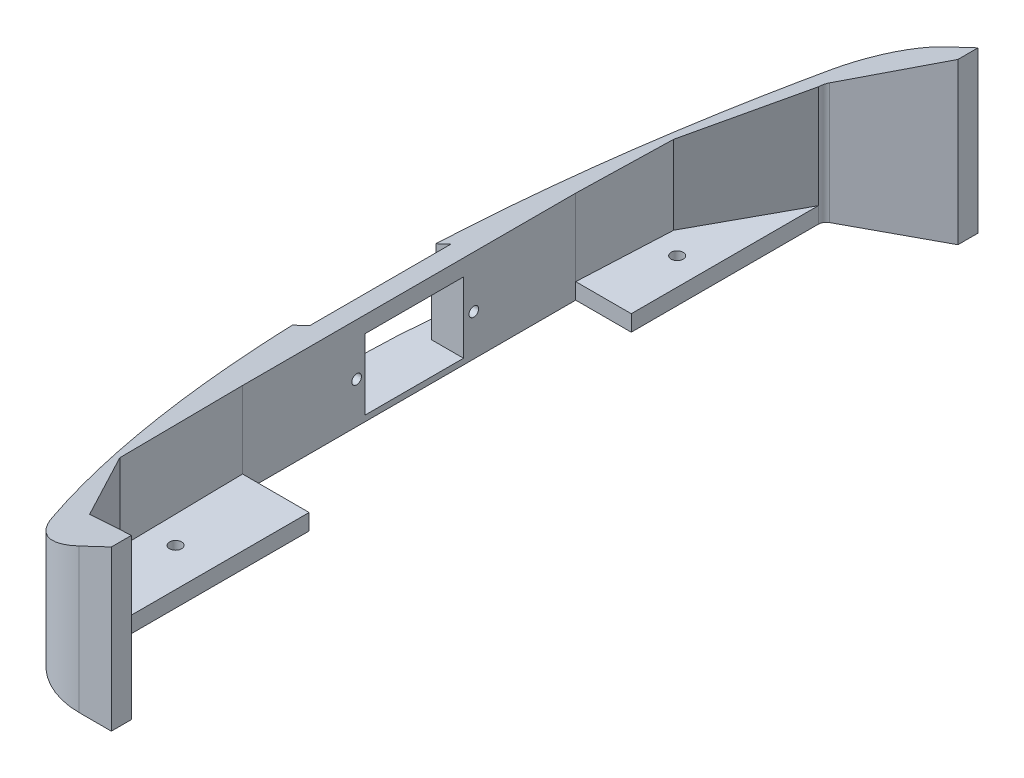
ISO-10303-21;
HEADER;
FILE_DESCRIPTION(('STEP AP214'),'2;1');
FILE_NAME('part.step','',(''),(''),'','','');
FILE_SCHEMA(('AUTOMOTIVE_DESIGN { 1 0 10303 214 1 1 1 1 }'));
ENDSEC;
DATA;
#1=APPLICATION_CONTEXT('core data for automotive mechanical design processes');
#2=APPLICATION_PROTOCOL_DEFINITION('international standard','automotive_design',2000,#1);
#3=PRODUCT_CONTEXT('',#1,'mechanical');
#4=PRODUCT('Part','Part','',(#3));
#5=PRODUCT_RELATED_PRODUCT_CATEGORY('part','',(#4));
#6=PRODUCT_DEFINITION_FORMATION('','',#4);
#7=PRODUCT_DEFINITION_CONTEXT('part definition',#1,'design');
#8=PRODUCT_DEFINITION('design','',#6,#7);
#9=PRODUCT_DEFINITION_SHAPE('','',#8);
#10=(LENGTH_UNIT() NAMED_UNIT(*) SI_UNIT(.MILLI.,.METRE.));
#11=(NAMED_UNIT(*) PLANE_ANGLE_UNIT() SI_UNIT($,.RADIAN.));
#12=(NAMED_UNIT(*) SI_UNIT($,.STERADIAN.) SOLID_ANGLE_UNIT());
#13=UNCERTAINTY_MEASURE_WITH_UNIT(LENGTH_MEASURE(1.E-05),#10,'distance_accuracy_value','');
#14=(GEOMETRIC_REPRESENTATION_CONTEXT(3) GLOBAL_UNCERTAINTY_ASSIGNED_CONTEXT((#13)) GLOBAL_UNIT_ASSIGNED_CONTEXT((#10,
#11,#12)) REPRESENTATION_CONTEXT('',''));
#15=CARTESIAN_POINT('',(0.,0.,0.));
#16=DIRECTION('',(0.,0.,1.));
#17=DIRECTION('',(1.,0.,0.));
#18=AXIS2_PLACEMENT_3D('',#15,#16,#17);
#19=CARTESIAN_POINT('',(-157.287069608446,24.1445424119972,-20.2563332421051));
#20=DIRECTION('',(0.,0.,-1.));
#21=DIRECTION('',(0.,1.,0.));
#22=AXIS2_PLACEMENT_3D('',#19,#20,#21);
#23=PLANE('',#22);
#24=DIRECTION('',(0.,1.,0.));
#25=VECTOR('',#24,1.);
#26=CARTESIAN_POINT('',(-150.41084995853,1.84369640274913,-20.2563332421051));
#27=LINE('',#26,#25);
#28=CARTESIAN_POINT('',(-150.41084995853,1.84369640274913,-20.2563332421051));
#29=VERTEX_POINT('',#28);
#30=CARTESIAN_POINT('',(-150.41084995853,24.1445424119972,-20.2563332421051));
#31=VERTEX_POINT('',#30);
#32=EDGE_CURVE('E535',#29,#31,#27,.T.);
#33=ORIENTED_EDGE('',*,*,#32,.T.);
#34=DIRECTION('',(1.,0.,0.));
#35=VECTOR('',#34,1.);
#36=CARTESIAN_POINT('',(-157.287069608446,24.1445424119972,-20.2563332421051));
#37=LINE('',#36,#35);
#38=CARTESIAN_POINT('',(-151.2216488135,24.1445424119972,-20.2563332421051));
#39=VERTEX_POINT('',#38);
#40=EDGE_CURVE('E244',#39,#31,#37,.T.);
#41=ORIENTED_EDGE('',*,*,#40,.F.);
#42=DIRECTION('',(0.90370145301097,0.428163150943495,0.));
#43=VECTOR('',#42,1.);
#44=CARTESIAN_POINT('',(-94.9613758314156,50.8,-20.2563332421051));
#45=LINE('',#44,#43);
#46=CARTESIAN_POINT('',(-155.973002728043,21.8934066452898,-20.2563332421051));
#47=VERTEX_POINT('',#46);
#48=EDGE_CURVE('E11',#47,#39,#45,.T.);
#49=ORIENTED_EDGE('',*,*,#48,.F.);
#50=DIRECTION('',(0.,-1.,0.));
#51=VECTOR('',#50,1.);
#52=CARTESIAN_POINT('',(-155.973002728043,50.8,-20.2563332421051));
#53=LINE('',#52,#51);
#54=CARTESIAN_POINT('',(-155.973002728043,1.84369640274912,-20.2563332421051));
#55=VERTEX_POINT('',#54);
#56=EDGE_CURVE('E473',#55,#47,#53,.F.);
#57=ORIENTED_EDGE('',*,*,#56,.F.);
#58=DIRECTION('',(1.,0.,0.));
#59=VECTOR('',#58,1.);
#60=CARTESIAN_POINT('',(-157.287069608446,1.84369640274913,-20.2563332421051));
#61=LINE('',#60,#59);
#62=EDGE_CURVE('E483',#55,#29,#61,.T.);
#63=ORIENTED_EDGE('',*,*,#62,.T.);
#64=EDGE_LOOP('',(#33,#41,#49,#57,#63));
#65=FACE_BOUND('',#64,.T.);
#66=ADVANCED_FACE('F39',(#65),#23,.F.);
#67=CARTESIAN_POINT('',(-157.287069608446,5.09454241199716,24.4046296643787));
#68=DIRECTION('',(0.,0.,1.));
#69=DIRECTION('',(1.,0.,0.));
#70=AXIS2_PLACEMENT_3D('',#67,#68,#69);
#71=PLANE('',#70);
#72=DIRECTION('',(0.,-1.,0.));
#73=VECTOR('',#72,1.);
#74=CARTESIAN_POINT('',(-150.41084995853,24.1445424119972,24.4046296643787));
#75=LINE('',#74,#73);
#76=CARTESIAN_POINT('',(-150.41084995853,24.1445424119972,24.4046296643787));
#77=VERTEX_POINT('',#76);
#78=CARTESIAN_POINT('',(-150.41084995853,1.84369640274913,24.4046296643787));
#79=VERTEX_POINT('',#78);
#80=EDGE_CURVE('E505',#77,#79,#75,.T.);
#81=ORIENTED_EDGE('',*,*,#80,.T.);
#82=DIRECTION('',(1.,0.,0.));
#83=VECTOR('',#82,1.);
#84=CARTESIAN_POINT('',(-157.287069608446,1.84369640274913,24.4046296643787));
#85=LINE('',#84,#83);
#86=CARTESIAN_POINT('',(-156.70448526814,1.84369640274913,24.4046296643787));
#87=VERTEX_POINT('',#86);
#88=EDGE_CURVE('E479',#87,#79,#85,.T.);
#89=ORIENTED_EDGE('',*,*,#88,.F.);
#90=DIRECTION('',(0.,-1.,0.));
#91=VECTOR('',#90,1.);
#92=CARTESIAN_POINT('',(-156.70448526814,50.8,24.4046296643787));
#93=LINE('',#92,#91);
#94=CARTESIAN_POINT('',(-156.70448526814,21.5468387957145,24.4046296643787));
#95=VERTEX_POINT('',#94);
#96=EDGE_CURVE('E230',#95,#87,#93,.T.);
#97=ORIENTED_EDGE('',*,*,#96,.F.);
#98=DIRECTION('',(-0.90370145301097,-0.428163150943495,0.));
#99=VECTOR('',#98,1.);
#100=CARTESIAN_POINT('',(-94.9613758314156,50.8,24.4046296643787));
#101=LINE('',#100,#99);
#102=CARTESIAN_POINT('',(-151.2216488135,24.1445424119971,24.4046296643787));
#103=VERTEX_POINT('',#102);
#104=EDGE_CURVE('E223',#103,#95,#101,.T.);
#105=ORIENTED_EDGE('',*,*,#104,.F.);
#106=DIRECTION('',(1.,0.,0.));
#107=VECTOR('',#106,1.);
#108=CARTESIAN_POINT('',(-157.287069608446,24.1445424119972,24.4046296643787));
#109=LINE('',#108,#107);
#110=EDGE_CURVE('E226',#103,#77,#109,.T.);
#111=ORIENTED_EDGE('',*,*,#110,.T.);
#112=EDGE_LOOP('',(#81,#89,#97,#105,#111));
#113=FACE_BOUND('',#112,.T.);
#114=ADVANCED_FACE('F225',(#113),#71,.F.);
#115=CARTESIAN_POINT('',(-119.167015714981,50.8,56.6451992567958));
#116=DIRECTION('',(-1.,0.,0.));
#117=DIRECTION('',(0.,0.,1.));
#118=AXIS2_PLACEMENT_3D('',#115,#116,#117);
#119=PLANE('',#118);
#120=DIRECTION('',(0.,0.,-1.));
#121=VECTOR('',#120,1.);
#122=CARTESIAN_POINT('',(-119.167015714981,5.07999999999999,126.112255784861));
#123=LINE('',#122,#121);
#124=CARTESIAN_POINT('',(-119.167015714981,5.07999999999999,126.112255784861));
#125=VERTEX_POINT('',#124);
#126=CARTESIAN_POINT('',(-119.167015714981,5.07999999999999,56.6451992567958));
#127=VERTEX_POINT('',#126);
#128=EDGE_CURVE('E399',#125,#127,#123,.T.);
#129=ORIENTED_EDGE('',*,*,#128,.F.);
#130=DIRECTION('',(0.,-1.,0.));
#131=VECTOR('',#130,1.);
#132=CARTESIAN_POINT('',(-119.167015714981,50.8,126.112255784861));
#133=LINE('',#132,#131);
#134=CARTESIAN_POINT('',(-119.167015714981,0.,126.112255784861));
#135=VERTEX_POINT('',#134);
#136=EDGE_CURVE('E295',#125,#135,#133,.T.);
#137=ORIENTED_EDGE('',*,*,#136,.T.);
#138=DIRECTION('',(0.,0.,-1.));
#139=VECTOR('',#138,1.);
#140=CARTESIAN_POINT('',(-119.167015714981,0.,56.6451992567958));
#141=LINE('',#140,#139);
#142=CARTESIAN_POINT('',(-119.167015714981,0.,56.6451992567958));
#143=VERTEX_POINT('',#142);
#144=EDGE_CURVE('E331',#135,#143,#141,.T.);
#145=ORIENTED_EDGE('',*,*,#144,.T.);
#146=DIRECTION('',(0.,-1.,0.));
#147=VECTOR('',#146,1.);
#148=CARTESIAN_POINT('',(-119.167015714981,50.8,56.6451992567958));
#149=LINE('',#148,#147);
#150=EDGE_CURVE('E296',#127,#143,#149,.T.);
#151=ORIENTED_EDGE('',*,*,#150,.F.);
#152=EDGE_LOOP('',(#129,#137,#145,#151));
#153=FACE_BOUND('',#152,.T.);
#154=ADVANCED_FACE('F591',(#153),#119,.F.);
#155=CARTESIAN_POINT('',(-140.25084995853,50.8,56.6451992567958));
#156=DIRECTION('',(0.,0.,1.));
#157=DIRECTION('',(1.,0.,0.));
#158=AXIS2_PLACEMENT_3D('',#155,#156,#157);
#159=PLANE('',#158);
#160=DIRECTION('',(-1.,0.,0.));
#161=VECTOR('',#160,1.);
#162=CARTESIAN_POINT('',(-119.167015714981,5.07999999999999,56.6451992567958));
#163=LINE('',#162,#161);
#164=CARTESIAN_POINT('',(-140.25084995853,5.07999999999999,56.6451992567958));
#165=VERTEX_POINT('',#164);
#166=EDGE_CURVE('E395',#127,#165,#163,.T.);
#167=ORIENTED_EDGE('',*,*,#166,.F.);
#168=ORIENTED_EDGE('',*,*,#150,.T.);
#169=DIRECTION('',(-1.,0.,0.));
#170=VECTOR('',#169,1.);
#171=CARTESIAN_POINT('',(-140.25084995853,0.,56.6451992567958));
#172=LINE('',#171,#170);
#173=CARTESIAN_POINT('',(-140.25084995853,0.,56.6451992567958));
#174=VERTEX_POINT('',#173);
#175=EDGE_CURVE('E327',#143,#174,#172,.T.);
#176=ORIENTED_EDGE('',*,*,#175,.T.);
#177=DIRECTION('',(0.,-1.,0.));
#178=VECTOR('',#177,1.);
#179=CARTESIAN_POINT('',(-140.25084995853,50.8,56.6451992567958));
#180=LINE('',#179,#178);
#181=EDGE_CURVE('E302',#165,#174,#180,.T.);
#182=ORIENTED_EDGE('',*,*,#181,.F.);
#183=EDGE_LOOP('',(#167,#168,#176,#182));
#184=FACE_BOUND('',#183,.T.);
#185=ADVANCED_FACE('F637',(#184),#159,.F.);
#186=CARTESIAN_POINT('',(-122.67867117166,50.8,-48.8107966844399));
#187=DIRECTION('',(0.,0.,-1.));
#188=DIRECTION('',(-1.,0.,0.));
#189=AXIS2_PLACEMENT_3D('',#186,#187,#188);
#190=PLANE('',#189);
#191=DIRECTION('',(1.,0.,0.));
#192=VECTOR('',#191,1.);
#193=CARTESIAN_POINT('',(-140.25084995853,5.07999999999999,-48.8107966844399));
#194=LINE('',#193,#192);
#195=CARTESIAN_POINT('',(-140.25084995853,5.07999999999999,-48.8107966844399));
#196=VERTEX_POINT('',#195);
#197=CARTESIAN_POINT('',(-122.67867117166,5.07999999999999,-48.8107966844399));
#198=VERTEX_POINT('',#197);
#199=EDGE_CURVE('E386',#196,#198,#194,.T.);
#200=ORIENTED_EDGE('',*,*,#199,.F.);
#201=DIRECTION('',(0.,-1.,0.));
#202=VECTOR('',#201,1.);
#203=CARTESIAN_POINT('',(-140.25084995853,50.8,-48.8107966844399));
#204=LINE('',#203,#202);
#205=CARTESIAN_POINT('',(-140.25084995853,0.,-48.8107966844399));
#206=VERTEX_POINT('',#205);
#207=EDGE_CURVE('E306',#196,#206,#204,.T.);
#208=ORIENTED_EDGE('',*,*,#207,.T.);
#209=DIRECTION('',(1.,0.,0.));
#210=VECTOR('',#209,1.);
#211=CARTESIAN_POINT('',(-122.67867117166,0.,-48.8107966844399));
#212=LINE('',#211,#210);
#213=CARTESIAN_POINT('',(-122.67867117166,0.,-48.8107966844399));
#214=VERTEX_POINT('',#213);
#215=EDGE_CURVE('E319',#206,#214,#212,.T.);
#216=ORIENTED_EDGE('',*,*,#215,.T.);
#217=DIRECTION('',(0.,-1.,0.));
#218=VECTOR('',#217,1.);
#219=CARTESIAN_POINT('',(-122.67867117166,50.8,-48.8107966844399));
#220=LINE('',#219,#218);
#221=EDGE_CURVE('E307',#198,#214,#220,.T.);
#222=ORIENTED_EDGE('',*,*,#221,.F.);
#223=EDGE_LOOP('',(#200,#208,#216,#222));
#224=FACE_BOUND('',#223,.T.);
#225=ADVANCED_FACE('F634',(#224),#190,.F.);
#226=CARTESIAN_POINT('',(-122.67867117166,50.8,-107.999441440313));
#227=DIRECTION('',(-1.,0.,0.));
#228=DIRECTION('',(0.,0.,1.));
#229=AXIS2_PLACEMENT_3D('',#226,#227,#228);
#230=PLANE('',#229);
#231=DIRECTION('',(0.,0.,-1.));
#232=VECTOR('',#231,1.);
#233=CARTESIAN_POINT('',(-122.67867117166,5.07999999999999,-48.8107966844399));
#234=LINE('',#233,#232);
#235=CARTESIAN_POINT('',(-122.67867117166,5.07999999999999,-107.999441440313));
#236=VERTEX_POINT('',#235);
#237=EDGE_CURVE('E414',#198,#236,#234,.T.);
#238=ORIENTED_EDGE('',*,*,#237,.F.);
#239=ORIENTED_EDGE('',*,*,#221,.T.);
#240=DIRECTION('',(0.,0.,-1.));
#241=VECTOR('',#240,1.);
#242=CARTESIAN_POINT('',(-122.67867117166,0.,-107.999441440313));
#243=LINE('',#242,#241);
#244=CARTESIAN_POINT('',(-122.67867117166,0.,-107.999441440313));
#245=VERTEX_POINT('',#244);
#246=EDGE_CURVE('E314',#214,#245,#243,.T.);
#247=ORIENTED_EDGE('',*,*,#246,.T.);
#248=DIRECTION('',(0.,-1.,0.));
#249=VECTOR('',#248,1.);
#250=CARTESIAN_POINT('',(-122.67867117166,50.8,-107.999441440313));
#251=LINE('',#250,#249);
#252=EDGE_CURVE('E313',#236,#245,#251,.T.);
#253=ORIENTED_EDGE('',*,*,#252,.F.);
#254=EDGE_LOOP('',(#238,#239,#247,#253));
#255=FACE_BOUND('',#254,.T.);
#256=ADVANCED_FACE('F628',(#255),#230,.F.);
#257=CARTESIAN_POINT('',(-131.296368681906,50.8,-71.9636007432042));
#258=DIRECTION('',(0.,-1.,0.));
#259=DIRECTION('',(0.,0.,-1.));
#260=AXIS2_PLACEMENT_3D('',#257,#258,#259);
#261=CYLINDRICAL_SURFACE('',#260,1.90499999999999);
#262=CARTESIAN_POINT('',(-131.296368681906,0.,-71.9636007432042));
#263=DIRECTION('',(0.,1.,0.));
#264=DIRECTION('',(0.,0.,1.));
#265=AXIS2_PLACEMENT_3D('',#262,#263,#264);
#266=CIRCLE('',#265,1.90499999999999);
#267=CARTESIAN_POINT('',(-131.296368681906,0.,-70.0586007432042));
#268=VERTEX_POINT('',#267);
#269=EDGE_CURVE('E373',#268,#268,#266,.T.);
#270=ORIENTED_EDGE('',*,*,#269,.F.);
#271=EDGE_LOOP('',(#270));
#272=FACE_BOUND('',#271,.T.);
#273=CARTESIAN_POINT('',(-131.296368681906,5.07999999999999,-71.9636007432042));
#274=DIRECTION('',(0.,1.,0.));
#275=DIRECTION('',(0.,0.,1.));
#276=AXIS2_PLACEMENT_3D('',#273,#274,#275);
#277=CIRCLE('',#276,1.90499999999999);
#278=CARTESIAN_POINT('',(-131.296368681906,5.07999999999999,-70.0586007432042));
#279=VERTEX_POINT('',#278);
#280=EDGE_CURVE('E254',#279,#279,#277,.T.);
#281=ORIENTED_EDGE('',*,*,#280,.T.);
#282=EDGE_LOOP('',(#281));
#283=FACE_BOUND('',#282,.T.);
#284=ADVANCED_FACE('F624',(#272,#283),#261,.F.);
#285=CARTESIAN_POINT('',(-131.296368681906,50.8,86.7863992567958));
#286=DIRECTION('',(0.,-1.,0.));
#287=DIRECTION('',(0.,0.,-1.));
#288=AXIS2_PLACEMENT_3D('',#285,#286,#287);
#289=CYLINDRICAL_SURFACE('',#288,1.90499999999999);
#290=CARTESIAN_POINT('',(-131.296368681906,0.,86.7863992567958));
#291=DIRECTION('',(0.,1.,0.));
#292=DIRECTION('',(0.,0.,1.));
#293=AXIS2_PLACEMENT_3D('',#290,#291,#292);
#294=CIRCLE('',#293,1.90499999999999);
#295=CARTESIAN_POINT('',(-131.296368681906,0.,88.6913992567958));
#296=VERTEX_POINT('',#295);
#297=EDGE_CURVE('E258',#296,#296,#294,.T.);
#298=ORIENTED_EDGE('',*,*,#297,.F.);
#299=EDGE_LOOP('',(#298));
#300=FACE_BOUND('',#299,.T.);
#301=CARTESIAN_POINT('',(-131.296368681906,5.07999999999999,86.7863992567958));
#302=DIRECTION('',(0.,1.,0.));
#303=DIRECTION('',(0.,0.,1.));
#304=AXIS2_PLACEMENT_3D('',#301,#302,#303);
#305=CIRCLE('',#304,1.90499999999999);
#306=CARTESIAN_POINT('',(-131.296368681906,5.07999999999999,88.6913992567958));
#307=VERTEX_POINT('',#306);
#308=EDGE_CURVE('E259',#307,#307,#305,.T.);
#309=ORIENTED_EDGE('',*,*,#308,.T.);
#310=EDGE_LOOP('',(#309));
#311=FACE_BOUND('',#310,.T.);
#312=ADVANCED_FACE('F620',(#300,#311),#289,.F.);
#313=CARTESIAN_POINT('',(-120.13867117166,0.,-107.999441440313));
#314=DIRECTION('',(0.,-1.,0.));
#315=DIRECTION('',(0.,0.,-1.));
#316=AXIS2_PLACEMENT_3D('',#313,#314,#315);
#317=PLANE('',#316);
#318=ORIENTED_EDGE('',*,*,#269,.T.);
#319=EDGE_LOOP('',(#318));
#320=FACE_BOUND('',#319,.T.);
#321=CARTESIAN_POINT('',(-120.13867117166,0.,-107.999441440313));
#322=DIRECTION('',(0.,-1.,0.));
#323=DIRECTION('',(0.,0.,-1.));
#324=AXIS2_PLACEMENT_3D('',#321,#322,#323);
#325=CIRCLE('',#324,2.54);
#326=CARTESIAN_POINT('',(-121.345326631998,0.,-110.23452143889));
#327=VERTEX_POINT('',#326);
#328=EDGE_CURVE('E369',#245,#327,#325,.T.);
#329=ORIENTED_EDGE('',*,*,#328,.F.);
#330=ORIENTED_EDGE('',*,*,#246,.F.);
#331=ORIENTED_EDGE('',*,*,#215,.F.);
#332=DIRECTION('',(0.,0.,-1.));
#333=VECTOR('',#332,1.);
#334=CARTESIAN_POINT('',(-140.25084995853,0.,-48.8107966844399));
#335=LINE('',#334,#333);
#336=EDGE_CURVE('E323',#174,#206,#335,.T.);
#337=ORIENTED_EDGE('',*,*,#336,.F.);
#338=ORIENTED_EDGE('',*,*,#175,.F.);
#339=ORIENTED_EDGE('',*,*,#144,.F.);
#340=DIRECTION('',(-0.915612359132314,0.,-0.402062193950336));
#341=VECTOR('',#340,1.);
#342=CARTESIAN_POINT('',(-119.167015714981,0.,126.112255784861));
#343=LINE('',#342,#341);
#344=CARTESIAN_POINT('',(-95.6016450834867,0.,136.460242597021));
#345=VERTEX_POINT('',#344);
#346=EDGE_CURVE('E335',#345,#135,#343,.T.);
#347=ORIENTED_EDGE('',*,*,#346,.F.);
#348=DIRECTION('',(0.,0.,-1.));
#349=VECTOR('',#348,1.);
#350=CARTESIAN_POINT('',(-95.6016450834867,0.,142.810242597021));
#351=LINE('',#350,#349);
#352=CARTESIAN_POINT('',(-95.6016450834867,0.,142.810242597021));
#353=VERTEX_POINT('',#352);
#354=EDGE_CURVE('E339',#353,#345,#351,.T.);
#355=ORIENTED_EDGE('',*,*,#354,.F.);
#356=DIRECTION('',(1.,0.,0.));
#357=VECTOR('',#356,1.);
#358=CARTESIAN_POINT('',(-95.6016450834867,0.,142.810242597021));
#359=LINE('',#358,#357);
#360=CARTESIAN_POINT('',(-105.798207048452,0.,142.810242597021));
#361=VERTEX_POINT('',#360);
#362=EDGE_CURVE('E343',#361,#353,#359,.T.);
#363=ORIENTED_EDGE('',*,*,#362,.F.);
#364=CARTESIAN_POINT('',(-105.798207048452,0.,117.410242597021));
#365=DIRECTION('',(0.,1.,0.));
#366=DIRECTION('',(0.,0.,1.));
#367=AXIS2_PLACEMENT_3D('',#364,#365,#366);
#368=CIRCLE('',#367,25.4);
#369=CARTESIAN_POINT('',(-128.532661200605,0.,128.737404395268));
#370=VERTEX_POINT('',#369);
#371=EDGE_CURVE('E347',#370,#361,#368,.T.);
#372=ORIENTED_EDGE('',*,*,#371,.F.);
#373=CARTESIAN_POINT('',(116.713834990151,0.,6.54635796793397));
#374=DIRECTION('',(0.,1.,0.));
#375=DIRECTION('',(0.,0.,1.));
#376=AXIS2_PLACEMENT_3D('',#373,#374,#375);
#377=CIRCLE('',#376,274.000904598597);
#378=CARTESIAN_POINT('',(-127.91877537442,0.,-116.869125935284));
#379=VERTEX_POINT('',#378);
#380=EDGE_CURVE('E351',#379,#370,#377,.T.);
#381=ORIENTED_EDGE('',*,*,#380,.F.);
#382=CARTESIAN_POINT('',(-105.241228698568,0.,-105.428458264008));
#383=DIRECTION('',(0.,1.,0.));
#384=DIRECTION('',(0.,0.,-1.));
#385=AXIS2_PLACEMENT_3D('',#382,#383,#384);
#386=CIRCLE('',#385,25.4);
#387=CARTESIAN_POINT('',(-105.241228698568,0.,-130.828458264008));
#388=VERTEX_POINT('',#387);
#389=EDGE_CURVE('E355',#388,#379,#386,.T.);
#390=ORIENTED_EDGE('',*,*,#389,.F.);
#391=DIRECTION('',(-1.,0.,0.));
#392=VECTOR('',#391,1.);
#393=CARTESIAN_POINT('',(-94.961375831414,0.,-130.828458264007));
#394=LINE('',#393,#392);
#395=CARTESIAN_POINT('',(-94.961375831414,0.,-130.828458264007));
#396=VERTEX_POINT('',#395);
#397=EDGE_CURVE('E359',#396,#388,#394,.T.);
#398=ORIENTED_EDGE('',*,*,#397,.F.);
#399=DIRECTION('',(2.49144537022181E-13,0.,-1.));
#400=VECTOR('',#399,1.);
#401=CARTESIAN_POINT('',(-94.9613758314156,0.,-124.478458264008));
#402=LINE('',#401,#400);
#403=CARTESIAN_POINT('',(-94.9613758314156,0.,-124.478458264008));
#404=VERTEX_POINT('',#403);
#405=EDGE_CURVE('E363',#404,#396,#402,.T.);
#406=ORIENTED_EDGE('',*,*,#405,.F.);
#407=DIRECTION('',(0.879952755345086,0.,-0.475061204857429));
#408=VECTOR('',#407,1.);
#409=CARTESIAN_POINT('',(-94.9613758314156,0.,-124.478458264008));
#410=LINE('',#409,#408);
#411=EDGE_CURVE('E366',#327,#404,#410,.T.);
#412=ORIENTED_EDGE('',*,*,#411,.F.);
#413=EDGE_LOOP('',(#329,#330,#331,#337,#338,#339,#347,#355,#363,#372,#381,#390,#398,#406,#412));
#414=FACE_BOUND('',#413,.T.);
#415=ORIENTED_EDGE('',*,*,#297,.T.);
#416=EDGE_LOOP('',(#415));
#417=FACE_BOUND('',#416,.T.);
#418=ADVANCED_FACE('F623',(#320,#414,#417),#317,.T.);
#419=CARTESIAN_POINT('',(-120.13867117166,50.8,-107.999441440313));
#420=DIRECTION('',(0.,-1.,0.));
#421=DIRECTION('',(0.,0.,-1.));
#422=AXIS2_PLACEMENT_3D('',#419,#420,#421);
#423=CYLINDRICAL_SURFACE('',#422,2.54);
#424=DIRECTION('',(0.,-1.,0.));
#425=VECTOR('',#424,1.);
#426=CARTESIAN_POINT('',(-121.345326631998,50.8,-110.23452143889));
#427=LINE('',#426,#425);
#428=CARTESIAN_POINT('',(-121.345326631998,38.2995935090322,-110.23452143889));
#429=VERTEX_POINT('',#428);
#430=EDGE_CURVE('E253',#429,#327,#427,.T.);
#431=ORIENTED_EDGE('',*,*,#430,.F.);
#432=CARTESIAN_POINT('',(-120.13867117166,38.8712927159773,-107.999441440313));
#433=DIRECTION('',(0.428163150943495,-0.90370145301097,0.));
#434=DIRECTION('',(-0.90370145301097,-0.428163150943495,0.));
#435=AXIS2_PLACEMENT_3D('',#432,#433,#434);
#436=ELLIPSE('',#435,2.81066273771851,2.54);
#437=CARTESIAN_POINT('',(-122.67867117166,37.6678705019562,-107.999441440313));
#438=VERTEX_POINT('',#437);
#439=EDGE_CURVE('E451',#429,#438,#436,.F.);
#440=ORIENTED_EDGE('',*,*,#439,.T.);
#441=EDGE_CURVE('E310',#438,#236,#251,.T.);
#442=ORIENTED_EDGE('',*,*,#441,.T.);
#443=ORIENTED_EDGE('',*,*,#252,.T.);
#444=ORIENTED_EDGE('',*,*,#328,.T.);
#445=EDGE_LOOP('',(#431,#440,#442,#443,#444));
#446=FACE_BOUND('',#445,.T.);
#447=ADVANCED_FACE('F41',(#446),#423,.F.);
#448=CARTESIAN_POINT('',(-94.9613758314156,50.8,-124.478458264008));
#449=DIRECTION('',(-0.475061204857429,0.,-0.879952755345086));
#450=DIRECTION('',(-0.879952755345086,0.,0.475061204857429));
#451=AXIS2_PLACEMENT_3D('',#448,#449,#450);
#452=PLANE('',#451);
#453=DIRECTION('',(0.,-1.,0.));
#454=VECTOR('',#453,1.);
#455=CARTESIAN_POINT('',(-94.9613758314156,50.8,-124.478458264008));
#456=LINE('',#455,#454);
#457=CARTESIAN_POINT('',(-94.9613758314156,50.8,-124.478458264008));
#458=VERTEX_POINT('',#457);
#459=EDGE_CURVE('E266',#458,#404,#456,.T.);
#460=ORIENTED_EDGE('',*,*,#459,.F.);
#461=DIRECTION('',(-0.812193524538385,-0.384807767525009,0.43847994338434));
#462=VECTOR('',#461,1.);
#463=CARTESIAN_POINT('',(-94.9613758314156,50.8,-124.478458264008));
#464=LINE('',#463,#462);
#465=EDGE_CURVE('E431',#458,#429,#464,.T.);
#466=ORIENTED_EDGE('',*,*,#465,.T.);
#467=ORIENTED_EDGE('',*,*,#430,.T.);
#468=ORIENTED_EDGE('',*,*,#411,.T.);
#469=EDGE_LOOP('',(#460,#466,#467,#468));
#470=FACE_BOUND('',#469,.T.);
#471=ADVANCED_FACE('F707',(#470),#452,.F.);
#472=CARTESIAN_POINT('',(-94.9613758314156,50.8,-124.478458264008));
#473=DIRECTION('',(-1.,0.,-2.49144537022181E-13));
#474=DIRECTION('',(-2.49144537022181E-13,0.,1.));
#475=AXIS2_PLACEMENT_3D('',#472,#473,#474);
#476=PLANE('',#475);
#477=ORIENTED_EDGE('',*,*,#405,.T.);
#478=DIRECTION('',(0.,-1.,0.));
#479=VECTOR('',#478,1.);
#480=CARTESIAN_POINT('',(-94.961375831414,50.8,-130.828458264007));
#481=LINE('',#480,#479);
#482=CARTESIAN_POINT('',(-94.9613758314156,50.8,-130.828458264008));
#483=VERTEX_POINT('',#482);
#484=EDGE_CURVE('E270',#483,#396,#481,.T.);
#485=ORIENTED_EDGE('',*,*,#484,.F.);
#486=DIRECTION('',(2.49144537022181E-13,0.,-1.));
#487=VECTOR('',#486,1.);
#488=CARTESIAN_POINT('',(-94.9613758314156,50.8,-124.478458264008));
#489=LINE('',#488,#487);
#490=EDGE_CURVE('E318',#458,#483,#489,.T.);
#491=ORIENTED_EDGE('',*,*,#490,.F.);
#492=ORIENTED_EDGE('',*,*,#459,.T.);
#493=EDGE_LOOP('',(#477,#485,#491,#492));
#494=FACE_BOUND('',#493,.T.);
#495=ADVANCED_FACE('F713',(#494),#476,.F.);
#496=CARTESIAN_POINT('',(-94.961375831414,50.8,-130.828458264007));
#497=DIRECTION('',(0.,0.,1.));
#498=DIRECTION('',(1.,0.,0.));
#499=AXIS2_PLACEMENT_3D('',#496,#497,#498);
#500=PLANE('',#499);
#501=DIRECTION('',(0.,-1.,0.));
#502=VECTOR('',#501,1.);
#503=CARTESIAN_POINT('',(-105.241228698568,50.8,-130.828458264008));
#504=LINE('',#503,#502);
#505=CARTESIAN_POINT('',(-105.241228698568,45.9295262609452,-130.828458264008));
#506=VERTEX_POINT('',#505);
#507=EDGE_CURVE('E274',#506,#388,#504,.T.);
#508=ORIENTED_EDGE('',*,*,#507,.F.);
#509=DIRECTION('',(0.90370145301097,0.428163150943495,0.));
#510=VECTOR('',#509,1.);
#511=CARTESIAN_POINT('',(-94.9613758314156,50.8,-130.828458264008));
#512=LINE('',#511,#510);
#513=EDGE_CURVE('E463',#506,#483,#512,.T.);
#514=ORIENTED_EDGE('',*,*,#513,.T.);
#515=ORIENTED_EDGE('',*,*,#484,.T.);
#516=ORIENTED_EDGE('',*,*,#397,.T.);
#517=EDGE_LOOP('',(#508,#514,#515,#516));
#518=FACE_BOUND('',#517,.T.);
#519=ADVANCED_FACE('F715',(#518),#500,.F.);
#520=CARTESIAN_POINT('',(-105.241228698568,50.8,-105.428458264008));
#521=DIRECTION('',(0.,-1.,0.));
#522=DIRECTION('',(0.,0.,-1.));
#523=AXIS2_PLACEMENT_3D('',#520,#521,#522);
#524=CYLINDRICAL_SURFACE('',#523,25.4);
#525=DIRECTION('',(0.,-1.,0.));
#526=VECTOR('',#525,1.);
#527=CARTESIAN_POINT('',(-127.91877537442,50.8,-116.869125935284));
#528=LINE('',#527,#526);
#529=CARTESIAN_POINT('',(-127.91877537442,35.1851705801506,-116.869125935284));
#530=VERTEX_POINT('',#529);
#531=EDGE_CURVE('E277',#530,#379,#528,.T.);
#532=ORIENTED_EDGE('',*,*,#531,.F.);
#533=CARTESIAN_POINT('',(-105.241228698568,45.9295262609452,-105.428458264008));
#534=DIRECTION('',(0.428163150943495,-0.90370145301097,0.));
#535=DIRECTION('',(-0.90370145301097,-0.428163150943495,0.));
#536=AXIS2_PLACEMENT_3D('',#533,#534,#535);
#537=ELLIPSE('',#536,28.106627377185,25.4);
#538=EDGE_CURVE('E402',#530,#506,#537,.T.);
#539=ORIENTED_EDGE('',*,*,#538,.T.);
#540=ORIENTED_EDGE('',*,*,#507,.T.);
#541=ORIENTED_EDGE('',*,*,#389,.T.);
#542=EDGE_LOOP('',(#532,#539,#540,#541));
#543=FACE_BOUND('',#542,.T.);
#544=ADVANCED_FACE('F663',(#543),#524,.T.);
#545=CARTESIAN_POINT('',(116.713834990151,50.8,6.54635796793397));
#546=DIRECTION('',(0.,-1.,0.));
#547=DIRECTION('',(0.,0.,-1.));
#548=AXIS2_PLACEMENT_3D('',#545,#546,#547);
#549=CYLINDRICAL_SURFACE('',#548,274.000904598597);
#550=ORIENTED_EDGE('',*,*,#96,.T.);
#551=CARTESIAN_POINT('',(116.713834990151,1.84369640274912,6.54635796793397));
#552=DIRECTION('',(0.,-1.,0.));
#553=DIRECTION('',(0.,0.,-1.));
#554=AXIS2_PLACEMENT_3D('',#551,#552,#553);
#555=CIRCLE('',#554,274.000904598597);
#556=EDGE_CURVE('E467',#87,#55,#555,.T.);
#557=ORIENTED_EDGE('',*,*,#556,.T.);
#558=ORIENTED_EDGE('',*,*,#56,.T.);
#559=CARTESIAN_POINT('',(116.713834990151,151.089232622148,6.54635796793397));
#560=DIRECTION('',(0.428163150943495,-0.90370145301097,0.));
#561=DIRECTION('',(-0.90370145301097,-0.428163150943495,0.));
#562=AXIS2_PLACEMENT_3D('',#559,#560,#561);
#563=ELLIPSE('',#562,303.198477423794,274.000904598597);
#564=EDGE_CURVE('E426',#47,#530,#563,.T.);
#565=ORIENTED_EDGE('',*,*,#564,.T.);
#566=ORIENTED_EDGE('',*,*,#531,.T.);
#567=ORIENTED_EDGE('',*,*,#380,.T.);
#568=DIRECTION('',(0.,-1.,0.));
#569=VECTOR('',#568,1.);
#570=CARTESIAN_POINT('',(-128.532661200605,50.8,128.737404395268));
#571=LINE('',#570,#569);
#572=CARTESIAN_POINT('',(-128.532661200605,34.8943186745979,128.737404395268));
#573=VERTEX_POINT('',#572);
#574=EDGE_CURVE('E280',#573,#370,#571,.T.);
#575=ORIENTED_EDGE('',*,*,#574,.F.);
#576=EDGE_CURVE('E423',#573,#95,#563,.T.);
#577=ORIENTED_EDGE('',*,*,#576,.T.);
#578=EDGE_LOOP('',(#550,#557,#558,#565,#566,#567,#575,#577));
#579=FACE_BOUND('',#578,.T.);
#580=ADVANCED_FACE('F658',(#579),#549,.T.);
#581=CARTESIAN_POINT('',(-105.798207048452,50.8,117.410242597021));
#582=DIRECTION('',(0.,-1.,0.));
#583=DIRECTION('',(0.,0.,-1.));
#584=AXIS2_PLACEMENT_3D('',#581,#582,#583);
#585=CYLINDRICAL_SURFACE('',#584,25.4);
#586=DIRECTION('',(0.,-1.,0.));
#587=VECTOR('',#586,1.);
#588=CARTESIAN_POINT('',(-105.798207048452,50.8,142.810242597021));
#589=LINE('',#588,#587);
#590=CARTESIAN_POINT('',(-105.798207048452,45.6656364503236,142.810242597021));
#591=VERTEX_POINT('',#590);
#592=EDGE_CURVE('E283',#591,#361,#589,.T.);
#593=ORIENTED_EDGE('',*,*,#592,.F.);
#594=CARTESIAN_POINT('',(-105.798207048452,45.6656364503236,117.410242597021));
#595=DIRECTION('',(0.428163150943495,-0.90370145301097,0.));
#596=DIRECTION('',(-0.90370145301097,-0.428163150943495,0.));
#597=AXIS2_PLACEMENT_3D('',#594,#595,#596);
#598=ELLIPSE('',#597,28.106627377185,25.4);
#599=EDGE_CURVE('E427',#591,#573,#598,.T.);
#600=ORIENTED_EDGE('',*,*,#599,.T.);
#601=ORIENTED_EDGE('',*,*,#574,.T.);
#602=ORIENTED_EDGE('',*,*,#371,.T.);
#603=EDGE_LOOP('',(#593,#600,#601,#602));
#604=FACE_BOUND('',#603,.T.);
#605=ADVANCED_FACE('F675',(#604),#585,.T.);
#606=CARTESIAN_POINT('',(-95.6016450834867,50.8,142.810242597021));
#607=DIRECTION('',(0.,0.,-1.));
#608=DIRECTION('',(-1.,0.,0.));
#609=AXIS2_PLACEMENT_3D('',#606,#607,#608);
#610=PLANE('',#609);
#611=DIRECTION('',(0.,-1.,0.));
#612=VECTOR('',#611,1.);
#613=CARTESIAN_POINT('',(-95.6016450834867,50.8,142.810242597021));
#614=LINE('',#613,#612);
#615=CARTESIAN_POINT('',(-95.6016450834867,50.4966479366547,142.810242597021));
#616=VERTEX_POINT('',#615);
#617=EDGE_CURVE('E286',#616,#353,#614,.T.);
#618=ORIENTED_EDGE('',*,*,#617,.F.);
#619=DIRECTION('',(0.90370145301097,0.428163150943495,0.));
#620=VECTOR('',#619,1.);
#621=CARTESIAN_POINT('',(-94.9613758314156,50.8,142.810242597021));
#622=LINE('',#621,#620);
#623=EDGE_CURVE('E464',#591,#616,#622,.T.);
#624=ORIENTED_EDGE('',*,*,#623,.F.);
#625=ORIENTED_EDGE('',*,*,#592,.T.);
#626=ORIENTED_EDGE('',*,*,#362,.T.);
#627=EDGE_LOOP('',(#618,#624,#625,#626));
#628=FACE_BOUND('',#627,.T.);
#629=ADVANCED_FACE('F679',(#628),#610,.F.);
#630=CARTESIAN_POINT('',(-95.6016450834867,50.8,142.810242597021));
#631=DIRECTION('',(-1.,0.,0.));
#632=DIRECTION('',(0.,0.,1.));
#633=AXIS2_PLACEMENT_3D('',#630,#631,#632);
#634=PLANE('',#633);
#635=DIRECTION('',(0.,-1.,0.));
#636=VECTOR('',#635,1.);
#637=CARTESIAN_POINT('',(-95.6016450834867,50.8,136.460242597021));
#638=LINE('',#637,#636);
#639=CARTESIAN_POINT('',(-95.6016450834867,50.4966479366547,136.460242597021));
#640=VERTEX_POINT('',#639);
#641=EDGE_CURVE('E289',#640,#345,#638,.T.);
#642=ORIENTED_EDGE('',*,*,#641,.F.);
#643=DIRECTION('',(0.,0.,1.));
#644=VECTOR('',#643,1.);
#645=CARTESIAN_POINT('',(-95.6016450834867,50.4966479366547,142.810242597021));
#646=LINE('',#645,#644);
#647=EDGE_CURVE('E435',#640,#616,#646,.T.);
#648=ORIENTED_EDGE('',*,*,#647,.T.);
#649=ORIENTED_EDGE('',*,*,#617,.T.);
#650=ORIENTED_EDGE('',*,*,#354,.T.);
#651=EDGE_LOOP('',(#642,#648,#649,#650));
#652=FACE_BOUND('',#651,.T.);
#653=ADVANCED_FACE('F578',(#652),#634,.F.);
#654=CARTESIAN_POINT('',(-119.167015714981,50.8,126.112255784861));
#655=DIRECTION('',(-0.402062193950336,0.,0.915612359132314));
#656=DIRECTION('',(0.915612359132315,0.,0.402062193950336));
#657=AXIS2_PLACEMENT_3D('',#654,#655,#656);
#658=PLANE('',#657);
#659=CARTESIAN_POINT('',(-119.167015714981,39.3316516769779,126.112255784861));
#660=VERTEX_POINT('',#659);
#661=EDGE_CURVE('E292',#660,#125,#133,.T.);
#662=ORIENTED_EDGE('',*,*,#661,.F.);
#663=DIRECTION('',(0.839980234489331,0.397972784851595,0.368850739710137));
#664=VECTOR('',#663,1.);
#665=CARTESIAN_POINT('',(-115.333269889962,41.148035491442,127.795723949179));
#666=LINE('',#665,#664);
#667=EDGE_CURVE('E439',#660,#640,#666,.T.);
#668=ORIENTED_EDGE('',*,*,#667,.T.);
#669=ORIENTED_EDGE('',*,*,#641,.T.);
#670=ORIENTED_EDGE('',*,*,#346,.T.);
#671=ORIENTED_EDGE('',*,*,#136,.F.);
#672=EDGE_LOOP('',(#662,#668,#669,#670,#671));
#673=FACE_BOUND('',#672,.T.);
#674=ADVANCED_FACE('F567',(#673),#658,.F.);
#675=CARTESIAN_POINT('',(-140.25084995853,50.8,-48.8107966844399));
#676=DIRECTION('',(-1.,0.,0.));
#677=DIRECTION('',(0.,0.,1.));
#678=AXIS2_PLACEMENT_3D('',#675,#676,#677);
#679=PLANE('',#678);
#680=DIRECTION('',(0.,0.,1.));
#681=VECTOR('',#680,1.);
#682=CARTESIAN_POINT('',(-140.25084995853,24.1445424119972,24.4046296643787));
#683=LINE('',#682,#681);
#684=CARTESIAN_POINT('',(-140.25084995853,24.1445424119972,-13.2935462906493));
#685=VERTEX_POINT('',#684);
#686=CARTESIAN_POINT('',(-140.25084995853,24.1445424119972,17.8803190212992));
#687=VERTEX_POINT('',#686);
#688=EDGE_CURVE('E484',#685,#687,#683,.T.);
#689=ORIENTED_EDGE('',*,*,#688,.F.);
#690=DIRECTION('',(0.,-1.,0.));
#691=VECTOR('',#690,1.);
#692=CARTESIAN_POINT('',(-140.25084995853,1.84369640274913,-13.2935462906493));
#693=LINE('',#692,#691);
#694=CARTESIAN_POINT('',(-140.25084995853,1.84369640274913,-13.2935462906493));
#695=VERTEX_POINT('',#694);
#696=EDGE_CURVE('E531',#685,#695,#693,.T.);
#697=ORIENTED_EDGE('',*,*,#696,.T.);
#698=DIRECTION('',(0.,0.,-1.));
#699=VECTOR('',#698,1.);
#700=CARTESIAN_POINT('',(-140.25084995853,1.84369640274913,24.4046296643787));
#701=LINE('',#700,#699);
#702=CARTESIAN_POINT('',(-140.25084995853,1.84369640274913,17.8803190212992));
#703=VERTEX_POINT('',#702);
#704=EDGE_CURVE('E60',#703,#695,#701,.T.);
#705=ORIENTED_EDGE('',*,*,#704,.F.);
#706=DIRECTION('',(0.,1.,0.));
#707=VECTOR('',#706,1.);
#708=CARTESIAN_POINT('',(-140.25084995853,24.1445424119972,17.8803190212992));
#709=LINE('',#708,#707);
#710=EDGE_CURVE('E501',#703,#687,#709,.T.);
#711=ORIENTED_EDGE('',*,*,#710,.T.);
#712=EDGE_LOOP('',(#689,#697,#705,#711));
#713=FACE_BOUND('',#712,.T.);
#714=CARTESIAN_POINT('',(-140.25084995853,29.3423782575196,-48.8107966844399));
#715=VERTEX_POINT('',#714);
#716=EDGE_CURVE('E303',#715,#196,#204,.T.);
#717=ORIENTED_EDGE('',*,*,#716,.F.);
#718=DIRECTION('',(0.,0.,1.));
#719=VECTOR('',#718,1.);
#720=CARTESIAN_POINT('',(-140.25084995853,29.3423782575196,-48.8107966844399));
#721=LINE('',#720,#719);
#722=CARTESIAN_POINT('',(-140.25084995853,29.3423782575196,56.6451992567958));
#723=VERTEX_POINT('',#722);
#724=EDGE_CURVE('E455',#715,#723,#721,.T.);
#725=ORIENTED_EDGE('',*,*,#724,.T.);
#726=EDGE_CURVE('E299',#723,#165,#180,.T.);
#727=ORIENTED_EDGE('',*,*,#726,.T.);
#728=ORIENTED_EDGE('',*,*,#181,.T.);
#729=ORIENTED_EDGE('',*,*,#336,.T.);
#730=ORIENTED_EDGE('',*,*,#207,.F.);
#731=EDGE_LOOP('',(#717,#725,#727,#728,#729,#730));
#732=FACE_BOUND('',#731,.T.);
#733=CARTESIAN_POINT('',(-140.25084995853,12.9915124882281,20.5300131676629));
#734=DIRECTION('',(1.,0.,0.));
#735=DIRECTION('',(0.,0.,1.));
#736=AXIS2_PLACEMENT_3D('',#733,#734,#735);
#737=CIRCLE('',#736,1.524);
#738=CARTESIAN_POINT('',(-140.25084995853,12.9915124882281,22.0540131676629));
#739=VERTEX_POINT('',#738);
#740=EDGE_CURVE('E518',#739,#739,#737,.T.);
#741=ORIENTED_EDGE('',*,*,#740,.F.);
#742=EDGE_LOOP('',(#741));
#743=FACE_BOUND('',#742,.T.);
#744=CARTESIAN_POINT('',(-140.25084995853,12.9915124882281,-16.5539868323371));
#745=DIRECTION('',(1.,0.,0.));
#746=DIRECTION('',(0.,0.,-1.));
#747=AXIS2_PLACEMENT_3D('',#744,#745,#746);
#748=CIRCLE('',#747,1.524);
#749=CARTESIAN_POINT('',(-140.25084995853,12.9915124882281,-18.0779868323371));
#750=VERTEX_POINT('',#749);
#751=EDGE_CURVE('E547',#750,#750,#748,.T.);
#752=ORIENTED_EDGE('',*,*,#751,.F.);
#753=EDGE_LOOP('',(#752));
#754=FACE_BOUND('',#753,.T.);
#755=ADVANCED_FACE('F564',(#713,#732,#743,#754),#679,.F.);
#756=CARTESIAN_POINT('',(-139.542068036554,5.07999999999999,96.1924862045695));
#757=DIRECTION('',(-0.826545969979296,0.,0.562869220610778));
#758=DIRECTION('',(0.562869220610778,0.,0.826545969979296));
#759=AXIS2_PLACEMENT_3D('',#756,#757,#758);
#760=PLANE('',#759);
#761=DIRECTION('',(0.,1.,0.));
#762=VECTOR('',#761,1.);
#763=CARTESIAN_POINT('',(-139.542068036554,5.07999999999999,96.1924862045695));
#764=LINE('',#763,#762);
#765=CARTESIAN_POINT('',(-139.542068036554,5.07999999999999,96.1924862045695));
#766=VERTEX_POINT('',#765);
#767=CARTESIAN_POINT('',(-139.542068036554,29.6781908204342,96.1924862045695));
#768=VERTEX_POINT('',#767);
#769=EDGE_CURVE('E382',#766,#768,#764,.T.);
#770=ORIENTED_EDGE('',*,*,#769,.T.);
#771=DIRECTION('',(0.543861988773809,0.257675432540179,0.798634778000701));
#772=VECTOR('',#771,1.);
#773=CARTESIAN_POINT('',(-142.989255379065,28.0449538819025,91.1304598912016));
#774=LINE('',#773,#772);
#775=EDGE_CURVE('E443',#768,#660,#774,.T.);
#776=ORIENTED_EDGE('',*,*,#775,.T.);
#777=ORIENTED_EDGE('',*,*,#661,.T.);
#778=DIRECTION('',(0.562869220610778,0.,0.826545969979296));
#779=VECTOR('',#778,1.);
#780=CARTESIAN_POINT('',(-139.542068036554,5.07999999999999,96.1924862045695));
#781=LINE('',#780,#779);
#782=EDGE_CURVE('E387',#766,#125,#781,.T.);
#783=ORIENTED_EDGE('',*,*,#782,.F.);
#784=EDGE_LOOP('',(#770,#776,#777,#783));
#785=FACE_BOUND('',#784,.T.);
#786=ADVANCED_FACE('F566',(#785),#760,.F.);
#787=CARTESIAN_POINT('',(-140.25084995853,5.07999999999999,56.6451992567958));
#788=DIRECTION('',(-0.999839432639536,0.,0.0179195128017252));
#789=DIRECTION('',(0.0179195128017252,0.,0.999839432639536));
#790=AXIS2_PLACEMENT_3D('',#787,#788,#789);
#791=PLANE('',#790);
#792=ORIENTED_EDGE('',*,*,#726,.F.);
#793=DIRECTION('',(0.017918867008128,0.00848974905813769,0.999803399857229));
#794=VECTOR('',#793,1.);
#795=CARTESIAN_POINT('',(-140.254540913688,29.3406295262489,56.4392582498287));
#796=LINE('',#795,#794);
#797=EDGE_CURVE('E447',#723,#768,#796,.T.);
#798=ORIENTED_EDGE('',*,*,#797,.T.);
#799=ORIENTED_EDGE('',*,*,#769,.F.);
#800=DIRECTION('',(0.0179195128017252,0.,0.999839432639536));
#801=VECTOR('',#800,1.);
#802=CARTESIAN_POINT('',(-140.25084995853,5.07999999999999,56.6451992567958));
#803=LINE('',#802,#801);
#804=EDGE_CURVE('E391',#165,#766,#803,.T.);
#805=ORIENTED_EDGE('',*,*,#804,.F.);
#806=EDGE_LOOP('',(#792,#798,#799,#805));
#807=FACE_BOUND('',#806,.T.);
#808=ADVANCED_FACE('F574',(#807),#791,.F.);
#809=CARTESIAN_POINT('',(0.,5.07999999999999,0.));
#810=DIRECTION('',(0.,1.,0.));
#811=DIRECTION('',(0.,0.,1.));
#812=AXIS2_PLACEMENT_3D('',#809,#810,#811);
#813=PLANE('',#812);
#814=ORIENTED_EDGE('',*,*,#308,.F.);
#815=EDGE_LOOP('',(#814));
#816=FACE_BOUND('',#815,.T.);
#817=ORIENTED_EDGE('',*,*,#128,.T.);
#818=ORIENTED_EDGE('',*,*,#166,.T.);
#819=ORIENTED_EDGE('',*,*,#804,.T.);
#820=ORIENTED_EDGE('',*,*,#782,.T.);
#821=EDGE_LOOP('',(#817,#818,#819,#820));
#822=FACE_BOUND('',#821,.T.);
#823=ADVANCED_FACE('F609',(#816,#822),#813,.T.);
#824=CARTESIAN_POINT('',(-138.833286114577,5.07999999999999,-78.4051190623766));
#825=DIRECTION('',(-0.998854772123279,0.,-0.0478450018973053));
#826=DIRECTION('',(-0.0478450018973053,0.,0.998854772123279));
#827=AXIS2_PLACEMENT_3D('',#824,#825,#826);
#828=PLANE('',#827);
#829=DIRECTION('',(0.,1.,0.));
#830=VECTOR('',#829,1.);
#831=CARTESIAN_POINT('',(-138.833286114577,5.07999999999999,-78.4051190623766));
#832=LINE('',#831,#830);
#833=CARTESIAN_POINT('',(-138.833286114577,5.07999999999999,-78.4051190623766));
#834=VERTEX_POINT('',#833);
#835=CARTESIAN_POINT('',(-138.833286114577,30.0140033833488,-78.4051190623766));
#836=VERTEX_POINT('',#835);
#837=EDGE_CURVE('E263',#834,#836,#832,.T.);
#838=ORIENTED_EDGE('',*,*,#837,.T.);
#839=DIRECTION('',(-0.0478327139026736,-0.0226625789241692,0.998598237028892));
#840=VECTOR('',#839,1.);
#841=CARTESIAN_POINT('',(-138.860314889759,30.0011974666277,-77.8408423353534));
#842=LINE('',#841,#840);
#843=EDGE_CURVE('E459',#836,#715,#842,.T.);
#844=ORIENTED_EDGE('',*,*,#843,.T.);
#845=ORIENTED_EDGE('',*,*,#716,.T.);
#846=DIRECTION('',(-0.0478450018973053,0.,0.998854772123279));
#847=VECTOR('',#846,1.);
#848=CARTESIAN_POINT('',(-138.833286114577,5.07999999999999,-78.4051190623766));
#849=LINE('',#848,#847);
#850=EDGE_CURVE('E406',#834,#196,#849,.T.);
#851=ORIENTED_EDGE('',*,*,#850,.F.);
#852=EDGE_LOOP('',(#838,#844,#845,#851));
#853=FACE_BOUND('',#852,.T.);
#854=ADVANCED_FACE('F606',(#853),#828,.F.);
#855=CARTESIAN_POINT('',(-122.67867117166,5.07999999999999,-107.999441440313));
#856=DIRECTION('',(-0.877742702186898,0.,-0.479132287325371));
#857=DIRECTION('',(-0.479132287325371,0.,0.877742702186898));
#858=AXIS2_PLACEMENT_3D('',#855,#856,#857);
#859=PLANE('',#858);
#860=ORIENTED_EDGE('',*,*,#441,.F.);
#861=DIRECTION('',(-0.467244426725623,-0.221374930117769,0.855964827553794));
#862=VECTOR('',#861,1.);
#863=CARTESIAN_POINT('',(-126.049436737892,36.0708413048454,-101.824393432049));
#864=LINE('',#863,#862);
#865=EDGE_CURVE('E235',#438,#836,#864,.T.);
#866=ORIENTED_EDGE('',*,*,#865,.T.);
#867=ORIENTED_EDGE('',*,*,#837,.F.);
#868=DIRECTION('',(-0.479132287325371,0.,0.877742702186898));
#869=VECTOR('',#868,1.);
#870=CARTESIAN_POINT('',(-122.67867117166,5.07999999999999,-107.999441440313));
#871=LINE('',#870,#869);
#872=EDGE_CURVE('E410',#236,#834,#871,.T.);
#873=ORIENTED_EDGE('',*,*,#872,.F.);
#874=EDGE_LOOP('',(#860,#866,#867,#873));
#875=FACE_BOUND('',#874,.T.);
#876=ADVANCED_FACE('F604',(#875),#859,.F.);
#877=CARTESIAN_POINT('',(0.,5.07999999999999,0.));
#878=DIRECTION('',(0.,1.,0.));
#879=DIRECTION('',(0.,0.,1.));
#880=AXIS2_PLACEMENT_3D('',#877,#878,#879);
#881=PLANE('',#880);
#882=ORIENTED_EDGE('',*,*,#280,.F.);
#883=EDGE_LOOP('',(#882));
#884=FACE_BOUND('',#883,.T.);
#885=ORIENTED_EDGE('',*,*,#199,.T.);
#886=ORIENTED_EDGE('',*,*,#237,.T.);
#887=ORIENTED_EDGE('',*,*,#872,.T.);
#888=ORIENTED_EDGE('',*,*,#850,.T.);
#889=EDGE_LOOP('',(#885,#886,#887,#888));
#890=FACE_BOUND('',#889,.T.);
#891=ADVANCED_FACE('F601',(#884,#890),#881,.T.);
#892=CARTESIAN_POINT('',(-94.9613758314156,50.8,-130.828458264008));
#893=DIRECTION('',(0.428163150943495,-0.90370145301097,0.));
#894=DIRECTION('',(0.90370145301097,0.428163150943495,0.));
#895=AXIS2_PLACEMENT_3D('',#892,#893,#894);
#896=PLANE('',#895);
#897=ORIENTED_EDGE('',*,*,#564,.F.);
#898=ORIENTED_EDGE('',*,*,#48,.T.);
#899=DIRECTION('',(0.,0.,1.));
#900=VECTOR('',#899,1.);
#901=CARTESIAN_POINT('',(-151.2216488135,24.1445424119972,-130.828458264008));
#902=LINE('',#901,#900);
#903=EDGE_CURVE('E48',#39,#103,#902,.T.);
#904=ORIENTED_EDGE('',*,*,#903,.T.);
#905=ORIENTED_EDGE('',*,*,#104,.T.);
#906=ORIENTED_EDGE('',*,*,#576,.F.);
#907=ORIENTED_EDGE('',*,*,#599,.F.);
#908=ORIENTED_EDGE('',*,*,#623,.T.);
#909=ORIENTED_EDGE('',*,*,#647,.F.);
#910=ORIENTED_EDGE('',*,*,#667,.F.);
#911=ORIENTED_EDGE('',*,*,#775,.F.);
#912=ORIENTED_EDGE('',*,*,#797,.F.);
#913=ORIENTED_EDGE('',*,*,#724,.F.);
#914=ORIENTED_EDGE('',*,*,#843,.F.);
#915=ORIENTED_EDGE('',*,*,#865,.F.);
#916=ORIENTED_EDGE('',*,*,#439,.F.);
#917=ORIENTED_EDGE('',*,*,#465,.F.);
#918=ORIENTED_EDGE('',*,*,#490,.T.);
#919=ORIENTED_EDGE('',*,*,#513,.F.);
#920=ORIENTED_EDGE('',*,*,#538,.F.);
#921=EDGE_LOOP('',(#897,#898,#904,#905,#906,#907,#908,#909,#910,#911,#912,#913,#914,#915,#916,
#917,#918,#919,#920));
#922=FACE_BOUND('',#921,.T.);
#923=ADVANCED_FACE('F247',(#922),#896,.F.);
#924=CARTESIAN_POINT('',(-157.287069608446,1.84369640274913,24.4046296643787));
#925=DIRECTION('',(0.,-1.,0.));
#926=DIRECTION('',(0.,0.,-1.));
#927=AXIS2_PLACEMENT_3D('',#924,#925,#926);
#928=PLANE('',#927);
#929=ORIENTED_EDGE('',*,*,#704,.T.);
#930=DIRECTION('',(1.,0.,0.));
#931=VECTOR('',#930,1.);
#932=CARTESIAN_POINT('',(-150.41084995853,1.84369640274913,-13.2935462906493));
#933=LINE('',#932,#931);
#934=CARTESIAN_POINT('',(-150.41084995853,1.84369640274913,-13.2935462906493));
#935=VERTEX_POINT('',#934);
#936=EDGE_CURVE('E55',#935,#695,#933,.T.);
#937=ORIENTED_EDGE('',*,*,#936,.F.);
#938=DIRECTION('',(0.,0.,-1.));
#939=VECTOR('',#938,1.);
#940=CARTESIAN_POINT('',(-150.41084995853,1.84369640274913,-20.2563332421051));
#941=LINE('',#940,#939);
#942=EDGE_CURVE('E528',#935,#29,#941,.T.);
#943=ORIENTED_EDGE('',*,*,#942,.T.);
#944=ORIENTED_EDGE('',*,*,#62,.F.);
#945=ORIENTED_EDGE('',*,*,#556,.F.);
#946=ORIENTED_EDGE('',*,*,#88,.T.);
#947=DIRECTION('',(0.,0.,-1.));
#948=VECTOR('',#947,1.);
#949=CARTESIAN_POINT('',(-150.41084995853,1.84369640274913,24.4046296643787));
#950=LINE('',#949,#948);
#951=CARTESIAN_POINT('',(-150.41084995853,1.84369640274913,17.8803190212992));
#952=VERTEX_POINT('',#951);
#953=EDGE_CURVE('E513',#79,#952,#950,.T.);
#954=ORIENTED_EDGE('',*,*,#953,.T.);
#955=DIRECTION('',(1.,0.,0.));
#956=VECTOR('',#955,1.);
#957=CARTESIAN_POINT('',(-150.41084995853,1.84369640274913,17.8803190212992));
#958=LINE('',#957,#956);
#959=EDGE_CURVE('E495',#952,#703,#958,.T.);
#960=ORIENTED_EDGE('',*,*,#959,.T.);
#961=EDGE_LOOP('',(#929,#937,#943,#944,#945,#946,#954,#960));
#962=FACE_BOUND('',#961,.T.);
#963=ADVANCED_FACE('F596',(#962),#928,.F.);
#964=CARTESIAN_POINT('',(-157.287069608446,24.1445424119972,24.4046296643787));
#965=DIRECTION('',(0.,1.,0.));
#966=DIRECTION('',(0.,0.,1.));
#967=AXIS2_PLACEMENT_3D('',#964,#965,#966);
#968=PLANE('',#967);
#969=DIRECTION('',(0.,0.,1.));
#970=VECTOR('',#969,1.);
#971=CARTESIAN_POINT('',(-150.41084995853,24.1445424119972,-20.2563332421051));
#972=LINE('',#971,#970);
#973=CARTESIAN_POINT('',(-150.41084995853,24.1445424119972,-13.2935462906493));
#974=VERTEX_POINT('',#973);
#975=EDGE_CURVE('E542',#31,#974,#972,.T.);
#976=ORIENTED_EDGE('',*,*,#975,.T.);
#977=DIRECTION('',(1.,0.,0.));
#978=VECTOR('',#977,1.);
#979=CARTESIAN_POINT('',(-150.41084995853,24.1445424119972,-13.2935462906493));
#980=LINE('',#979,#978);
#981=EDGE_CURVE('E525',#974,#685,#980,.T.);
#982=ORIENTED_EDGE('',*,*,#981,.T.);
#983=ORIENTED_EDGE('',*,*,#688,.T.);
#984=DIRECTION('',(1.,0.,0.));
#985=VECTOR('',#984,1.);
#986=CARTESIAN_POINT('',(-150.41084995853,24.1445424119972,17.8803190212992));
#987=LINE('',#986,#985);
#988=CARTESIAN_POINT('',(-150.41084995853,24.1445424119972,17.8803190212992));
#989=VERTEX_POINT('',#988);
#990=EDGE_CURVE('E494',#989,#687,#987,.T.);
#991=ORIENTED_EDGE('',*,*,#990,.F.);
#992=DIRECTION('',(0.,0.,1.));
#993=VECTOR('',#992,1.);
#994=CARTESIAN_POINT('',(-150.41084995853,24.1445424119972,24.4046296643787));
#995=LINE('',#994,#993);
#996=EDGE_CURVE('E242',#989,#77,#995,.T.);
#997=ORIENTED_EDGE('',*,*,#996,.T.);
#998=ORIENTED_EDGE('',*,*,#110,.F.);
#999=ORIENTED_EDGE('',*,*,#903,.F.);
#1000=ORIENTED_EDGE('',*,*,#40,.T.);
#1001=EDGE_LOOP('',(#976,#982,#983,#991,#997,#998,#999,#1000));
#1002=FACE_BOUND('',#1001,.T.);
#1003=ADVANCED_FACE('F238',(#1002),#968,.F.);
#1004=CARTESIAN_POINT('',(-150.41084995853,24.1445424119972,17.8803190212992));
#1005=DIRECTION('',(0.,0.,-1.));
#1006=DIRECTION('',(-1.,0.,0.));
#1007=AXIS2_PLACEMENT_3D('',#1004,#1005,#1006);
#1008=PLANE('',#1007);
#1009=ORIENTED_EDGE('',*,*,#710,.F.);
#1010=ORIENTED_EDGE('',*,*,#959,.F.);
#1011=DIRECTION('',(0.,1.,0.));
#1012=VECTOR('',#1011,1.);
#1013=CARTESIAN_POINT('',(-150.41084995853,24.1445424119972,17.8803190212992));
#1014=LINE('',#1013,#1012);
#1015=EDGE_CURVE('E509',#952,#989,#1014,.T.);
#1016=ORIENTED_EDGE('',*,*,#1015,.T.);
#1017=ORIENTED_EDGE('',*,*,#990,.T.);
#1018=EDGE_LOOP('',(#1009,#1010,#1016,#1017));
#1019=FACE_BOUND('',#1018,.T.);
#1020=ADVANCED_FACE('F845',(#1019),#1008,.T.);
#1021=CARTESIAN_POINT('',(-150.41084995853,0.,0.));
#1022=DIRECTION('',(1.,0.,0.));
#1023=DIRECTION('',(0.,0.,-1.));
#1024=AXIS2_PLACEMENT_3D('',#1021,#1022,#1023);
#1025=PLANE('',#1024);
#1026=CARTESIAN_POINT('',(-150.41084995853,12.9915124882281,20.5300131676629));
#1027=DIRECTION('',(1.,0.,0.));
#1028=DIRECTION('',(0.,0.,1.));
#1029=AXIS2_PLACEMENT_3D('',#1026,#1027,#1028);
#1030=CIRCLE('',#1029,1.524);
#1031=CARTESIAN_POINT('',(-150.41084995853,12.9915124882281,22.0540131676629));
#1032=VERTEX_POINT('',#1031);
#1033=EDGE_CURVE('E506',#1032,#1032,#1030,.T.);
#1034=ORIENTED_EDGE('',*,*,#1033,.T.);
#1035=EDGE_LOOP('',(#1034));
#1036=FACE_BOUND('',#1035,.T.);
#1037=ORIENTED_EDGE('',*,*,#80,.F.);
#1038=ORIENTED_EDGE('',*,*,#996,.F.);
#1039=ORIENTED_EDGE('',*,*,#1015,.F.);
#1040=ORIENTED_EDGE('',*,*,#953,.F.);
#1041=EDGE_LOOP('',(#1037,#1038,#1039,#1040));
#1042=FACE_BOUND('',#1041,.T.);
#1043=ADVANCED_FACE('F852',(#1036,#1042),#1025,.F.);
#1044=CARTESIAN_POINT('',(-150.41084995853,12.9915124882281,20.5300131676629));
#1045=DIRECTION('',(1.,0.,0.));
#1046=DIRECTION('',(0.,0.,-1.));
#1047=AXIS2_PLACEMENT_3D('',#1044,#1045,#1046);
#1048=CYLINDRICAL_SURFACE('',#1047,1.524);
#1049=ORIENTED_EDGE('',*,*,#1033,.F.);
#1050=EDGE_LOOP('',(#1049));
#1051=FACE_BOUND('',#1050,.T.);
#1052=ORIENTED_EDGE('',*,*,#740,.T.);
#1053=EDGE_LOOP('',(#1052));
#1054=FACE_BOUND('',#1053,.T.);
#1055=ADVANCED_FACE('F861',(#1051,#1054),#1048,.F.);
#1056=CARTESIAN_POINT('',(-150.41084995853,1.84369640274913,-13.2935462906493));
#1057=DIRECTION('',(0.,0.,1.));
#1058=DIRECTION('',(1.,0.,0.));
#1059=AXIS2_PLACEMENT_3D('',#1056,#1057,#1058);
#1060=PLANE('',#1059);
#1061=ORIENTED_EDGE('',*,*,#696,.F.);
#1062=ORIENTED_EDGE('',*,*,#981,.F.);
#1063=DIRECTION('',(0.,-1.,0.));
#1064=VECTOR('',#1063,1.);
#1065=CARTESIAN_POINT('',(-150.41084995853,1.84369640274913,-13.2935462906493));
#1066=LINE('',#1065,#1064);
#1067=EDGE_CURVE('E539',#974,#935,#1066,.T.);
#1068=ORIENTED_EDGE('',*,*,#1067,.T.);
#1069=ORIENTED_EDGE('',*,*,#936,.T.);
#1070=EDGE_LOOP('',(#1061,#1062,#1068,#1069));
#1071=FACE_BOUND('',#1070,.T.);
#1072=ADVANCED_FACE('F871',(#1071),#1060,.T.);
#1073=CARTESIAN_POINT('',(-150.41084995853,0.,0.));
#1074=DIRECTION('',(1.,0.,0.));
#1075=DIRECTION('',(0.,0.,-1.));
#1076=AXIS2_PLACEMENT_3D('',#1073,#1074,#1075);
#1077=PLANE('',#1076);
#1078=CARTESIAN_POINT('',(-150.41084995853,12.9915124882281,-16.5539868323371));
#1079=DIRECTION('',(1.,0.,0.));
#1080=DIRECTION('',(0.,0.,-1.));
#1081=AXIS2_PLACEMENT_3D('',#1078,#1079,#1080);
#1082=CIRCLE('',#1081,1.524);
#1083=CARTESIAN_POINT('',(-150.41084995853,12.9915124882281,-18.0779868323371));
#1084=VERTEX_POINT('',#1083);
#1085=EDGE_CURVE('E536',#1084,#1084,#1082,.T.);
#1086=ORIENTED_EDGE('',*,*,#1085,.T.);
#1087=EDGE_LOOP('',(#1086));
#1088=FACE_BOUND('',#1087,.T.);
#1089=ORIENTED_EDGE('',*,*,#32,.F.);
#1090=ORIENTED_EDGE('',*,*,#942,.F.);
#1091=ORIENTED_EDGE('',*,*,#1067,.F.);
#1092=ORIENTED_EDGE('',*,*,#975,.F.);
#1093=EDGE_LOOP('',(#1089,#1090,#1091,#1092));
#1094=FACE_BOUND('',#1093,.T.);
#1095=ADVANCED_FACE('F555',(#1088,#1094),#1077,.F.);
#1096=CARTESIAN_POINT('',(-150.41084995853,12.9915124882281,-16.5539868323371));
#1097=DIRECTION('',(1.,0.,0.));
#1098=DIRECTION('',(0.,0.,-1.));
#1099=AXIS2_PLACEMENT_3D('',#1096,#1097,#1098);
#1100=CYLINDRICAL_SURFACE('',#1099,1.524);
#1101=ORIENTED_EDGE('',*,*,#1085,.F.);
#1102=EDGE_LOOP('',(#1101));
#1103=FACE_BOUND('',#1102,.T.);
#1104=ORIENTED_EDGE('',*,*,#751,.T.);
#1105=EDGE_LOOP('',(#1104));
#1106=FACE_BOUND('',#1105,.T.);
#1107=ADVANCED_FACE('F558',(#1103,#1106),#1100,.F.);
#1108=CLOSED_SHELL('',(#66,#114,#154,#185,#225,#256,#284,#312,#418,#447,#471,#495,#519,#544,
#580,#605,#629,#653,#674,#755,#786,#808,#823,#854,#876,#891,#923,#963,#1003,#1020,#1043,#1055,
#1072,#1095,#1107));
#1109=MANIFOLD_SOLID_BREP('B2',#1108);
#1110=ADVANCED_BREP_SHAPE_REPRESENTATION('',(#18,#1109),#14);
#1111=SHAPE_DEFINITION_REPRESENTATION(#9,#1110);
ENDSEC;
END-ISO-10303-21;
